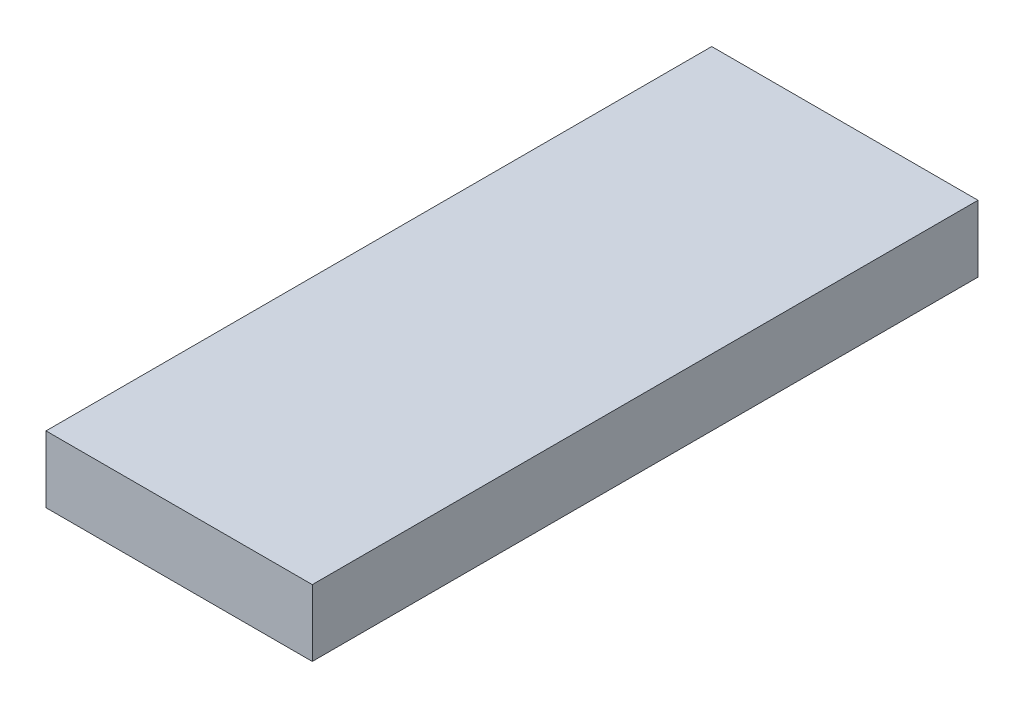
ISO-10303-21;
HEADER;
FILE_DESCRIPTION(('STEP AP214'),'2;1');
FILE_NAME('part.step','',(''),(''),'','','');
FILE_SCHEMA(('AUTOMOTIVE_DESIGN { 1 0 10303 214 1 1 1 1 }'));
ENDSEC;
DATA;
#1=APPLICATION_CONTEXT('core data for automotive mechanical design processes');
#2=APPLICATION_PROTOCOL_DEFINITION('international standard','automotive_design',2000,#1);
#3=PRODUCT_CONTEXT('',#1,'mechanical');
#4=PRODUCT('Part','Part','',(#3));
#5=PRODUCT_RELATED_PRODUCT_CATEGORY('part','',(#4));
#6=PRODUCT_DEFINITION_FORMATION('','',#4);
#7=PRODUCT_DEFINITION_CONTEXT('part definition',#1,'design');
#8=PRODUCT_DEFINITION('design','',#6,#7);
#9=PRODUCT_DEFINITION_SHAPE('','',#8);
#10=(LENGTH_UNIT() NAMED_UNIT(*) SI_UNIT(.MILLI.,.METRE.));
#11=(NAMED_UNIT(*) PLANE_ANGLE_UNIT() SI_UNIT($,.RADIAN.));
#12=(NAMED_UNIT(*) SI_UNIT($,.STERADIAN.) SOLID_ANGLE_UNIT());
#13=UNCERTAINTY_MEASURE_WITH_UNIT(LENGTH_MEASURE(1.E-05),#10,'distance_accuracy_value','');
#14=(GEOMETRIC_REPRESENTATION_CONTEXT(3) GLOBAL_UNCERTAINTY_ASSIGNED_CONTEXT((#13)) GLOBAL_UNIT_ASSIGNED_CONTEXT((#10,
#11,#12)) REPRESENTATION_CONTEXT('',''));
#15=CARTESIAN_POINT('',(0.,0.,0.));
#16=DIRECTION('',(0.,0.,1.));
#17=DIRECTION('',(1.,0.,0.));
#18=AXIS2_PLACEMENT_3D('',#15,#16,#17);
#19=CARTESIAN_POINT('',(0.,5.,0.));
#20=DIRECTION('',(1.,0.,0.));
#21=DIRECTION('',(0.,0.,-1.));
#22=AXIS2_PLACEMENT_3D('',#19,#20,#21);
#23=PLANE('',#22);
#24=DIRECTION('',(0.,0.,1.));
#25=VECTOR('',#24,1.);
#26=CARTESIAN_POINT('',(0.,0.,0.));
#27=LINE('',#26,#25);
#28=CARTESIAN_POINT('',(0.,0.,-50.));
#29=VERTEX_POINT('',#28);
#30=CARTESIAN_POINT('',(0.,0.,0.));
#31=VERTEX_POINT('',#30);
#32=EDGE_CURVE('E107',#29,#31,#27,.T.);
#33=ORIENTED_EDGE('',*,*,#32,.T.);
#34=DIRECTION('',(0.,-1.,0.));
#35=VECTOR('',#34,1.);
#36=CARTESIAN_POINT('',(0.,5.,0.));
#37=LINE('',#36,#35);
#38=CARTESIAN_POINT('',(0.,5.,0.));
#39=VERTEX_POINT('',#38);
#40=EDGE_CURVE('E11',#39,#31,#37,.T.);
#41=ORIENTED_EDGE('',*,*,#40,.F.);
#42=DIRECTION('',(0.,0.,1.));
#43=VECTOR('',#42,1.);
#44=CARTESIAN_POINT('',(0.,5.,0.));
#45=LINE('',#44,#43);
#46=CARTESIAN_POINT('',(0.,5.,-50.));
#47=VERTEX_POINT('',#46);
#48=EDGE_CURVE('E91',#47,#39,#45,.T.);
#49=ORIENTED_EDGE('',*,*,#48,.F.);
#50=DIRECTION('',(0.,-1.,0.));
#51=VECTOR('',#50,1.);
#52=CARTESIAN_POINT('',(0.,5.,-50.));
#53=LINE('',#52,#51);
#54=EDGE_CURVE('E103',#47,#29,#53,.T.);
#55=ORIENTED_EDGE('',*,*,#54,.T.);
#56=EDGE_LOOP('',(#33,#41,#49,#55));
#57=FACE_BOUND('',#56,.T.);
#58=ADVANCED_FACE('F39',(#57),#23,.F.);
#59=CARTESIAN_POINT('',(0.,5.,0.));
#60=DIRECTION('',(0.,0.,-1.));
#61=DIRECTION('',(-1.,0.,0.));
#62=AXIS2_PLACEMENT_3D('',#59,#60,#61);
#63=PLANE('',#62);
#64=DIRECTION('',(1.,0.,0.));
#65=VECTOR('',#64,1.);
#66=CARTESIAN_POINT('',(0.,0.,0.));
#67=LINE('',#66,#65);
#68=CARTESIAN_POINT('',(20.,0.,0.));
#69=VERTEX_POINT('',#68);
#70=EDGE_CURVE('E96',#31,#69,#67,.T.);
#71=ORIENTED_EDGE('',*,*,#70,.T.);
#72=DIRECTION('',(0.,-1.,0.));
#73=VECTOR('',#72,1.);
#74=CARTESIAN_POINT('',(20.,5.,0.));
#75=LINE('',#74,#73);
#76=CARTESIAN_POINT('',(20.,5.,0.));
#77=VERTEX_POINT('',#76);
#78=EDGE_CURVE('E48',#77,#69,#75,.T.);
#79=ORIENTED_EDGE('',*,*,#78,.F.);
#80=DIRECTION('',(1.,0.,0.));
#81=VECTOR('',#80,1.);
#82=CARTESIAN_POINT('',(0.,5.,0.));
#83=LINE('',#82,#81);
#84=EDGE_CURVE('E86',#39,#77,#83,.T.);
#85=ORIENTED_EDGE('',*,*,#84,.F.);
#86=ORIENTED_EDGE('',*,*,#40,.T.);
#87=EDGE_LOOP('',(#71,#79,#85,#86));
#88=FACE_BOUND('',#87,.T.);
#89=ADVANCED_FACE('F95',(#88),#63,.F.);
#90=CARTESIAN_POINT('',(20.,5.,0.));
#91=DIRECTION('',(-1.,0.,0.));
#92=DIRECTION('',(0.,0.,1.));
#93=AXIS2_PLACEMENT_3D('',#90,#91,#92);
#94=PLANE('',#93);
#95=DIRECTION('',(0.,0.,-1.));
#96=VECTOR('',#95,1.);
#97=CARTESIAN_POINT('',(20.,0.,0.));
#98=LINE('',#97,#96);
#99=CARTESIAN_POINT('',(20.,0.,-50.));
#100=VERTEX_POINT('',#99);
#101=EDGE_CURVE('E73',#69,#100,#98,.T.);
#102=ORIENTED_EDGE('',*,*,#101,.T.);
#103=DIRECTION('',(0.,-1.,0.));
#104=VECTOR('',#103,1.);
#105=CARTESIAN_POINT('',(20.,5.,-50.));
#106=LINE('',#105,#104);
#107=CARTESIAN_POINT('',(20.,5.,-50.));
#108=VERTEX_POINT('',#107);
#109=EDGE_CURVE('E98',#108,#100,#106,.T.);
#110=ORIENTED_EDGE('',*,*,#109,.F.);
#111=DIRECTION('',(0.,0.,-1.));
#112=VECTOR('',#111,1.);
#113=CARTESIAN_POINT('',(20.,5.,0.));
#114=LINE('',#113,#112);
#115=EDGE_CURVE('E89',#77,#108,#114,.T.);
#116=ORIENTED_EDGE('',*,*,#115,.F.);
#117=ORIENTED_EDGE('',*,*,#78,.T.);
#118=EDGE_LOOP('',(#102,#110,#116,#117));
#119=FACE_BOUND('',#118,.T.);
#120=ADVANCED_FACE('F99',(#119),#94,.F.);
#121=CARTESIAN_POINT('',(0.,5.,-50.));
#122=DIRECTION('',(0.,0.,1.));
#123=DIRECTION('',(1.,0.,0.));
#124=AXIS2_PLACEMENT_3D('',#121,#122,#123);
#125=PLANE('',#124);
#126=DIRECTION('',(-1.,0.,0.));
#127=VECTOR('',#126,1.);
#128=CARTESIAN_POINT('',(0.,0.,-50.));
#129=LINE('',#128,#127);
#130=EDGE_CURVE('E79',#100,#29,#129,.T.);
#131=ORIENTED_EDGE('',*,*,#130,.T.);
#132=ORIENTED_EDGE('',*,*,#54,.F.);
#133=DIRECTION('',(-1.,0.,0.));
#134=VECTOR('',#133,1.);
#135=CARTESIAN_POINT('',(0.,5.,-50.));
#136=LINE('',#135,#134);
#137=EDGE_CURVE('E56',#108,#47,#136,.T.);
#138=ORIENTED_EDGE('',*,*,#137,.F.);
#139=ORIENTED_EDGE('',*,*,#109,.T.);
#140=EDGE_LOOP('',(#131,#132,#138,#139));
#141=FACE_BOUND('',#140,.T.);
#142=ADVANCED_FACE('F120',(#141),#125,.F.);
#143=CARTESIAN_POINT('',(0.,5.,0.));
#144=DIRECTION('',(0.,-1.,0.));
#145=DIRECTION('',(0.,0.,-1.));
#146=AXIS2_PLACEMENT_3D('',#143,#144,#145);
#147=PLANE('',#146);
#148=ORIENTED_EDGE('',*,*,#48,.T.);
#149=ORIENTED_EDGE('',*,*,#84,.T.);
#150=ORIENTED_EDGE('',*,*,#115,.T.);
#151=ORIENTED_EDGE('',*,*,#137,.T.);
#152=EDGE_LOOP('',(#148,#149,#150,#151));
#153=FACE_BOUND('',#152,.T.);
#154=ADVANCED_FACE('F87',(#153),#147,.F.);
#155=CARTESIAN_POINT('',(0.,0.,0.));
#156=DIRECTION('',(0.,-1.,0.));
#157=DIRECTION('',(0.,0.,-1.));
#158=AXIS2_PLACEMENT_3D('',#155,#156,#157);
#159=PLANE('',#158);
#160=ORIENTED_EDGE('',*,*,#32,.F.);
#161=ORIENTED_EDGE('',*,*,#130,.F.);
#162=ORIENTED_EDGE('',*,*,#101,.F.);
#163=ORIENTED_EDGE('',*,*,#70,.F.);
#164=EDGE_LOOP('',(#160,#161,#162,#163));
#165=FACE_BOUND('',#164,.T.);
#166=ADVANCED_FACE('F123',(#165),#159,.T.);
#167=CLOSED_SHELL('',(#58,#89,#120,#142,#154,#166));
#168=MANIFOLD_SOLID_BREP('B2',#167);
#169=ADVANCED_BREP_SHAPE_REPRESENTATION('',(#18,#168),#14);
#170=SHAPE_DEFINITION_REPRESENTATION(#9,#169);
ENDSEC;
END-ISO-10303-21;
